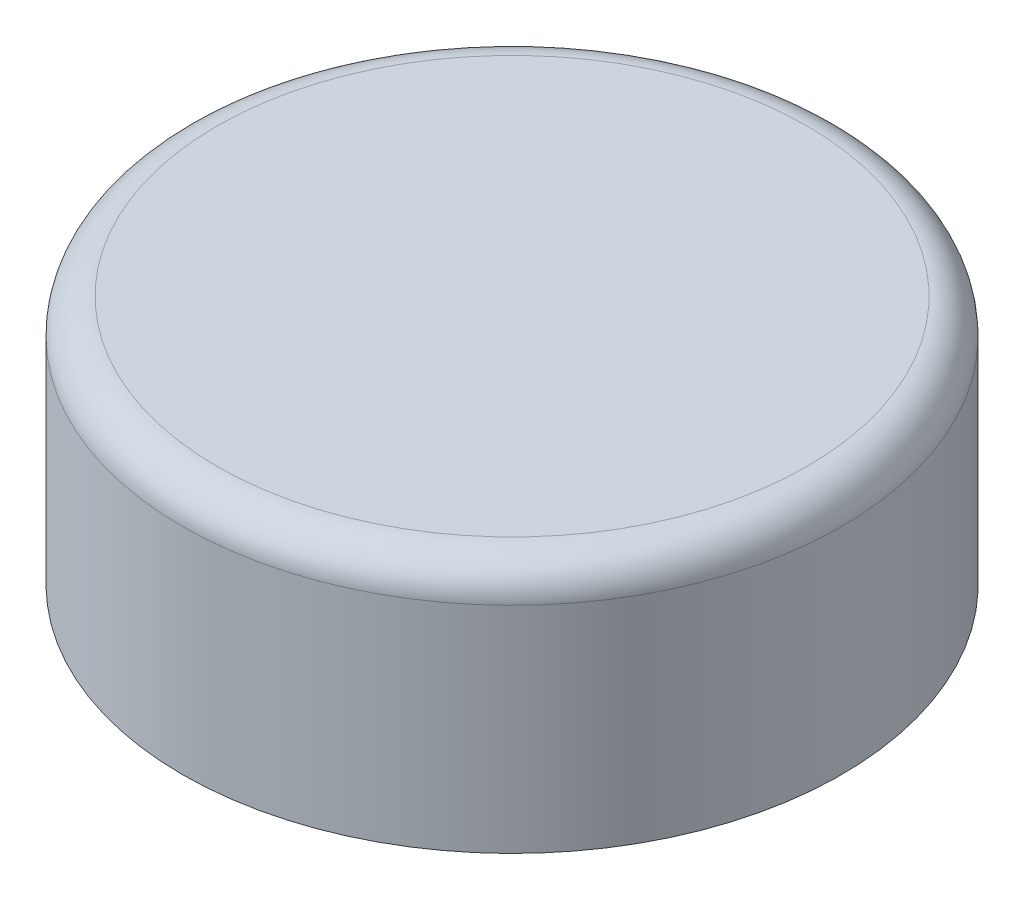
ISO-10303-21;
HEADER;
FILE_DESCRIPTION(('STEP AP214'),'2;1');
FILE_NAME('part.step','',(''),(''),'','','');
FILE_SCHEMA(('AUTOMOTIVE_DESIGN { 1 0 10303 214 1 1 1 1 }'));
ENDSEC;
DATA;
#1=APPLICATION_CONTEXT('core data for automotive mechanical design processes');
#2=APPLICATION_PROTOCOL_DEFINITION('international standard','automotive_design',2000,#1);
#3=PRODUCT_CONTEXT('',#1,'mechanical');
#4=PRODUCT('Part','Part','',(#3));
#5=PRODUCT_RELATED_PRODUCT_CATEGORY('part','',(#4));
#6=PRODUCT_DEFINITION_FORMATION('','',#4);
#7=PRODUCT_DEFINITION_CONTEXT('part definition',#1,'design');
#8=PRODUCT_DEFINITION('design','',#6,#7);
#9=PRODUCT_DEFINITION_SHAPE('','',#8);
#10=(LENGTH_UNIT() NAMED_UNIT(*) SI_UNIT(.MILLI.,.METRE.));
#11=(NAMED_UNIT(*) PLANE_ANGLE_UNIT() SI_UNIT($,.RADIAN.));
#12=(NAMED_UNIT(*) SI_UNIT($,.STERADIAN.) SOLID_ANGLE_UNIT());
#13=UNCERTAINTY_MEASURE_WITH_UNIT(LENGTH_MEASURE(1.E-05),#10,'distance_accuracy_value','');
#14=(GEOMETRIC_REPRESENTATION_CONTEXT(3) GLOBAL_UNCERTAINTY_ASSIGNED_CONTEXT((#13)) GLOBAL_UNIT_ASSIGNED_CONTEXT((#10,
#11,#12)) REPRESENTATION_CONTEXT('',''));
#15=CARTESIAN_POINT('',(0.,0.,0.));
#16=DIRECTION('',(0.,0.,1.));
#17=DIRECTION('',(1.,0.,0.));
#18=AXIS2_PLACEMENT_3D('',#15,#16,#17);
#19=CARTESIAN_POINT('',(0.,22.86,0.));
#20=DIRECTION('',(0.,-1.,0.));
#21=DIRECTION('',(0.,0.,-1.));
#22=AXIS2_PLACEMENT_3D('',#19,#20,#21);
#23=CYLINDRICAL_SURFACE('',#22,30.1879529182293);
#24=CARTESIAN_POINT('',(0.,19.685,0.));
#25=DIRECTION('',(0.,1.,0.));
#26=DIRECTION('',(0.,0.,1.));
#27=AXIS2_PLACEMENT_3D('',#24,#25,#26);
#28=CIRCLE('',#27,30.1879529182293);
#29=CARTESIAN_POINT('',(0.,19.685,30.1879529182293));
#30=VERTEX_POINT('',#29);
#31=EDGE_CURVE('E11',#30,#30,#28,.F.);
#32=ORIENTED_EDGE('',*,*,#31,.T.);
#33=EDGE_LOOP('',(#32));
#34=FACE_BOUND('',#33,.T.);
#35=CARTESIAN_POINT('',(0.,0.,0.));
#36=DIRECTION('',(0.,1.,0.));
#37=DIRECTION('',(0.,0.,1.));
#38=AXIS2_PLACEMENT_3D('',#35,#36,#37);
#39=CIRCLE('',#38,30.1879529182293);
#40=CARTESIAN_POINT('',(0.,0.,30.1879529182293));
#41=VERTEX_POINT('',#40);
#42=EDGE_CURVE('E43',#41,#41,#39,.T.);
#43=ORIENTED_EDGE('',*,*,#42,.T.);
#44=EDGE_LOOP('',(#43));
#45=FACE_BOUND('',#44,.T.);
#46=ADVANCED_FACE('F32',(#34,#45),#23,.T.);
#47=CARTESIAN_POINT('',(0.,22.86,0.));
#48=DIRECTION('',(0.,1.,0.));
#49=DIRECTION('',(0.,0.,1.));
#50=AXIS2_PLACEMENT_3D('',#47,#48,#49);
#51=PLANE('',#50);
#52=CARTESIAN_POINT('',(0.,22.86,0.));
#53=DIRECTION('',(0.,1.,0.));
#54=DIRECTION('',(0.,0.,1.));
#55=AXIS2_PLACEMENT_3D('',#52,#53,#54);
#56=CIRCLE('',#55,27.0129529182293);
#57=CARTESIAN_POINT('',(0.,22.86,27.0129529182293));
#58=VERTEX_POINT('',#57);
#59=EDGE_CURVE('E39',#58,#58,#56,.T.);
#60=ORIENTED_EDGE('',*,*,#59,.T.);
#61=EDGE_LOOP('',(#60));
#62=FACE_BOUND('',#61,.T.);
#63=ADVANCED_FACE('F53',(#62),#51,.T.);
#64=CARTESIAN_POINT('',(0.,0.,0.));
#65=DIRECTION('',(0.,1.,0.));
#66=DIRECTION('',(0.,0.,1.));
#67=AXIS2_PLACEMENT_3D('',#64,#65,#66);
#68=PLANE('',#67);
#69=ORIENTED_EDGE('',*,*,#42,.F.);
#70=EDGE_LOOP('',(#69));
#71=FACE_BOUND('',#70,.T.);
#72=ADVANCED_FACE('F51',(#71),#68,.F.);
#73=CARTESIAN_POINT('',(0.,19.685,0.));
#74=DIRECTION('',(0.,1.,0.));
#75=DIRECTION('',(0.,0.,1.));
#76=AXIS2_PLACEMENT_3D('',#73,#74,#75);
#77=TOROIDAL_SURFACE('',#76,27.0129529182293,3.175);
#78=ORIENTED_EDGE('',*,*,#31,.F.);
#79=EDGE_LOOP('',(#78));
#80=FACE_BOUND('',#79,.T.);
#81=ORIENTED_EDGE('',*,*,#59,.F.);
#82=EDGE_LOOP('',(#81));
#83=FACE_BOUND('',#82,.T.);
#84=ADVANCED_FACE('F34',(#80,#83),#77,.T.);
#85=CLOSED_SHELL('',(#46,#63,#72,#84));
#86=MANIFOLD_SOLID_BREP('B2',#85);
#87=ADVANCED_BREP_SHAPE_REPRESENTATION('',(#18,#86),#14);
#88=SHAPE_DEFINITION_REPRESENTATION(#9,#87);
ENDSEC;
END-ISO-10303-21;
